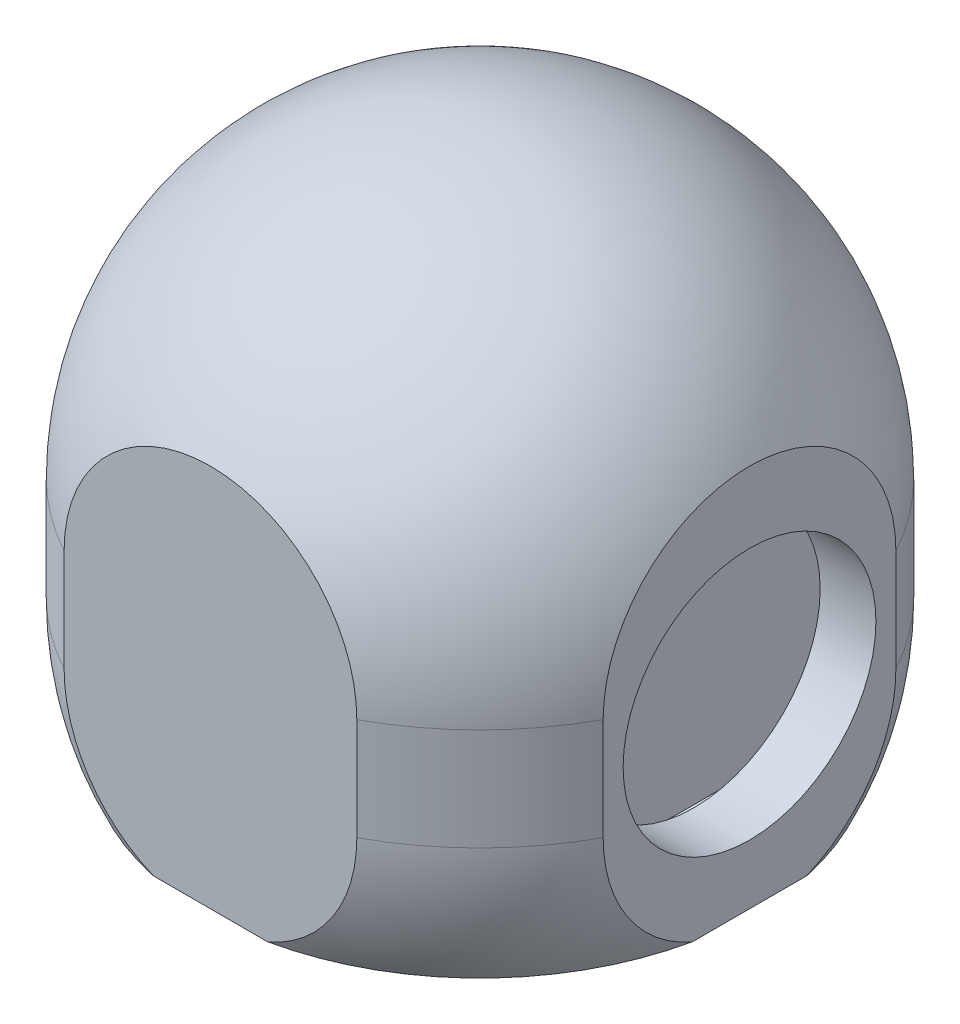
ISO-10303-21;
HEADER;
FILE_DESCRIPTION(('STEP AP214'),'2;1');
FILE_NAME('part.step','',(''),(''),'','','');
FILE_SCHEMA(('AUTOMOTIVE_DESIGN { 1 0 10303 214 1 1 1 1 }'));
ENDSEC;
DATA;
#1=APPLICATION_CONTEXT('core data for automotive mechanical design processes');
#2=APPLICATION_PROTOCOL_DEFINITION('international standard','automotive_design',2000,#1);
#3=PRODUCT_CONTEXT('',#1,'mechanical');
#4=PRODUCT('Part','Part','',(#3));
#5=PRODUCT_RELATED_PRODUCT_CATEGORY('part','',(#4));
#6=PRODUCT_DEFINITION_FORMATION('','',#4);
#7=PRODUCT_DEFINITION_CONTEXT('part definition',#1,'design');
#8=PRODUCT_DEFINITION('design','',#6,#7);
#9=PRODUCT_DEFINITION_SHAPE('','',#8);
#10=(LENGTH_UNIT() NAMED_UNIT(*) SI_UNIT(.MILLI.,.METRE.));
#11=(NAMED_UNIT(*) PLANE_ANGLE_UNIT() SI_UNIT($,.RADIAN.));
#12=(NAMED_UNIT(*) SI_UNIT($,.STERADIAN.) SOLID_ANGLE_UNIT());
#13=UNCERTAINTY_MEASURE_WITH_UNIT(LENGTH_MEASURE(1.E-05),#10,'distance_accuracy_value','');
#14=(GEOMETRIC_REPRESENTATION_CONTEXT(3) GLOBAL_UNCERTAINTY_ASSIGNED_CONTEXT((#13)) GLOBAL_UNIT_ASSIGNED_CONTEXT((#10,
#11,#12)) REPRESENTATION_CONTEXT('',''));
#15=CARTESIAN_POINT('',(0.,0.,0.));
#16=DIRECTION('',(0.,0.,1.));
#17=DIRECTION('',(1.,0.,0.));
#18=AXIS2_PLACEMENT_3D('',#15,#16,#17);
#19=CARTESIAN_POINT('',(0.,-41.5,0.));
#20=DIRECTION('',(0.,1.,0.));
#21=DIRECTION('',(0.,0.,1.));
#22=AXIS2_PLACEMENT_3D('',#19,#20,#21);
#23=PLANE('',#22);
#24=CARTESIAN_POINT('',(0.,-41.5,0.));
#25=DIRECTION('',(0.,1.,0.));
#26=DIRECTION('',(0.,0.,1.));
#27=AXIS2_PLACEMENT_3D('',#24,#25,#26);
#28=CIRCLE('',#27,69.408212770536);
#29=CARTESIAN_POINT('',(57.5000000000004,-41.5,-38.8747990348498));
#30=VERTEX_POINT('',#29);
#31=CARTESIAN_POINT('',(49.2499999999998,-41.5,-48.9074380846106));
#32=VERTEX_POINT('',#31);
#33=EDGE_CURVE('E416',#30,#32,#28,.T.);
#34=ORIENTED_EDGE('',*,*,#33,.T.);
#35=DIRECTION('',(0.,0.,1.));
#36=VECTOR('',#35,1.);
#37=CARTESIAN_POINT('',(49.2499999999998,-41.5,-56.2316636780383));
#38=LINE('',#37,#36);
#39=CARTESIAN_POINT('',(49.2499999999998,-41.5,48.9074380846106));
#40=VERTEX_POINT('',#39);
#41=EDGE_CURVE('E60',#32,#40,#38,.T.);
#42=ORIENTED_EDGE('',*,*,#41,.T.);
#43=CARTESIAN_POINT('',(0.,-41.5,0.));
#44=DIRECTION('',(0.,1.,0.));
#45=DIRECTION('',(0.,0.,1.));
#46=AXIS2_PLACEMENT_3D('',#43,#44,#45);
#47=CIRCLE('',#46,69.408212770536);
#48=CARTESIAN_POINT('',(57.4999999999996,-41.5,38.874799034851));
#49=VERTEX_POINT('',#48);
#50=EDGE_CURVE('E407',#40,#49,#47,.T.);
#51=ORIENTED_EDGE('',*,*,#50,.T.);
#52=DIRECTION('',(0.,0.,1.));
#53=VECTOR('',#52,1.);
#54=CARTESIAN_POINT('',(57.5,-41.5,6.0228053095044E-13));
#55=LINE('',#54,#53);
#56=EDGE_CURVE('E267',#30,#49,#55,.T.);
#57=ORIENTED_EDGE('',*,*,#56,.F.);
#58=EDGE_LOOP('',(#34,#42,#51,#57));
#59=FACE_BOUND('',#58,.T.);
#60=ADVANCED_FACE('F37',(#59),#23,.T.);
#61=CARTESIAN_POINT('',(0.,-41.5,0.));
#62=DIRECTION('',(0.,1.,0.));
#63=DIRECTION('',(0.,0.,1.));
#64=AXIS2_PLACEMENT_3D('',#61,#62,#63);
#65=CIRCLE('',#64,40.);
#66=CARTESIAN_POINT('',(0.,-41.5,40.));
#67=VERTEX_POINT('',#66);
#68=EDGE_CURVE('E461',#67,#67,#65,.T.);
#69=ORIENTED_EDGE('',*,*,#68,.F.);
#70=EDGE_LOOP('',(#69));
#71=FACE_BOUND('',#70,.T.);
#72=CARTESIAN_POINT('',(24.9987499687485,-41.5,64.75));
#73=VERTEX_POINT('',#72);
#74=CARTESIAN_POINT('',(44.2499999999998,-41.5,53.4737084930531));
#75=VERTEX_POINT('',#74);
#76=EDGE_CURVE('E413',#73,#75,#47,.T.);
#77=ORIENTED_EDGE('',*,*,#76,.T.);
#78=DIRECTION('',(0.,0.,-1.));
#79=VECTOR('',#78,1.);
#80=CARTESIAN_POINT('',(44.2499999999998,-41.5,-60.245331769358));
#81=LINE('',#80,#79);
#82=CARTESIAN_POINT('',(44.2499999999998,-41.5,-53.4737084930531));
#83=VERTEX_POINT('',#82);
#84=EDGE_CURVE('E484',#75,#83,#81,.T.);
#85=ORIENTED_EDGE('',*,*,#84,.T.);
#86=CARTESIAN_POINT('',(24.9987499687485,-41.5,-64.75));
#87=VERTEX_POINT('',#86);
#88=EDGE_CURVE('E387',#83,#87,#28,.T.);
#89=ORIENTED_EDGE('',*,*,#88,.T.);
#90=DIRECTION('',(1.,0.,0.));
#91=VECTOR('',#90,1.);
#92=CARTESIAN_POINT('',(0.,-41.5,-64.75));
#93=LINE('',#92,#91);
#94=CARTESIAN_POINT('',(-24.9987499687485,-41.5,-64.75));
#95=VERTEX_POINT('',#94);
#96=EDGE_CURVE('E399',#95,#87,#93,.T.);
#97=ORIENTED_EDGE('',*,*,#96,.F.);
#98=CARTESIAN_POINT('',(0.,-41.5,0.));
#99=DIRECTION('',(0.,1.,0.));
#100=DIRECTION('',(0.,0.,1.));
#101=AXIS2_PLACEMENT_3D('',#98,#99,#100);
#102=CIRCLE('',#101,69.408212770536);
#103=CARTESIAN_POINT('',(-57.4999999999999,-41.5,-38.8747990348506));
#104=VERTEX_POINT('',#103);
#105=EDGE_CURVE('E404',#95,#104,#102,.T.);
#106=ORIENTED_EDGE('',*,*,#105,.T.);
#107=DIRECTION('',(0.,0.,-1.));
#108=VECTOR('',#107,1.);
#109=CARTESIAN_POINT('',(-57.5,-41.5,-2.0076017698348E-13));
#110=LINE('',#109,#108);
#111=CARTESIAN_POINT('',(-57.5000000000001,-41.5,38.8747990348501));
#112=VERTEX_POINT('',#111);
#113=EDGE_CURVE('E376',#112,#104,#110,.T.);
#114=ORIENTED_EDGE('',*,*,#113,.F.);
#115=CARTESIAN_POINT('',(0.,-41.5,0.));
#116=DIRECTION('',(0.,1.,0.));
#117=DIRECTION('',(0.,0.,1.));
#118=AXIS2_PLACEMENT_3D('',#115,#116,#117);
#119=CIRCLE('',#118,69.408212770536);
#120=CARTESIAN_POINT('',(-24.9987499687485,-41.5,64.75));
#121=VERTEX_POINT('',#120);
#122=EDGE_CURVE('E409',#112,#121,#119,.T.);
#123=ORIENTED_EDGE('',*,*,#122,.T.);
#124=DIRECTION('',(-1.,0.,0.));
#125=VECTOR('',#124,1.);
#126=CARTESIAN_POINT('',(0.,-41.5,64.75));
#127=LINE('',#126,#125);
#128=EDGE_CURVE('E403',#73,#121,#127,.T.);
#129=ORIENTED_EDGE('',*,*,#128,.F.);
#130=EDGE_LOOP('',(#77,#85,#89,#97,#106,#114,#123,#129));
#131=FACE_BOUND('',#130,.T.);
#132=ADVANCED_FACE('F457',(#71,#131),#23,.T.);
#133=CARTESIAN_POINT('',(0.,13.75,0.));
#134=DIRECTION('',(0.,-1.,0.));
#135=DIRECTION('',(1.,0.,0.));
#136=AXIS2_PLACEMENT_3D('',#133,#134,#135);
#137=CYLINDRICAL_SURFACE('',#136,74.75);
#138=CARTESIAN_POINT('',(0.,-13.75,0.));
#139=DIRECTION('',(0.,-1.,0.));
#140=DIRECTION('',(1.,0.,0.));
#141=AXIS2_PLACEMENT_3D('',#138,#139,#140);
#142=CIRCLE('',#141,74.75);
#143=CARTESIAN_POINT('',(57.4999999999995,-13.75,47.7630872117796));
#144=VERTEX_POINT('',#143);
#145=CARTESIAN_POINT('',(49.2499999999999,-13.75,56.2316636780383));
#146=VERTEX_POINT('',#145);
#147=EDGE_CURVE('E249',#144,#146,#142,.T.);
#148=ORIENTED_EDGE('',*,*,#147,.T.);
#149=DIRECTION('',(0.,-1.,0.));
#150=VECTOR('',#149,1.);
#151=CARTESIAN_POINT('',(49.2499999999999,121.375708030891,56.2316636780383));
#152=LINE('',#151,#150);
#153=CARTESIAN_POINT('',(49.2499999999998,13.75,56.2316636780383));
#154=VERTEX_POINT('',#153);
#155=EDGE_CURVE('E234',#154,#146,#152,.T.);
#156=ORIENTED_EDGE('',*,*,#155,.F.);
#157=CARTESIAN_POINT('',(0.,13.75,0.));
#158=DIRECTION('',(0.,-1.,0.));
#159=DIRECTION('',(1.,0.,0.));
#160=AXIS2_PLACEMENT_3D('',#157,#158,#159);
#161=CIRCLE('',#160,74.75);
#162=CARTESIAN_POINT('',(57.4999999999995,13.75,47.7630872117796));
#163=VERTEX_POINT('',#162);
#164=EDGE_CURVE('E247',#163,#154,#161,.T.);
#165=ORIENTED_EDGE('',*,*,#164,.F.);
#166=DIRECTION('',(0.,-1.,0.));
#167=VECTOR('',#166,1.);
#168=CARTESIAN_POINT('',(57.4999999999995,13.75,47.7630872117796));
#169=LINE('',#168,#167);
#170=EDGE_CURVE('E266',#163,#144,#169,.T.);
#171=ORIENTED_EDGE('',*,*,#170,.T.);
#172=EDGE_LOOP('',(#148,#156,#165,#171));
#173=FACE_BOUND('',#172,.T.);
#174=ADVANCED_FACE('F246',(#173),#137,.F.);
#175=CARTESIAN_POINT('',(44.2499999999998,13.75,60.245331769358));
#176=VERTEX_POINT('',#175);
#177=CARTESIAN_POINT('',(37.3496987939662,13.75,64.75));
#178=VERTEX_POINT('',#177);
#179=EDGE_CURVE('E257',#176,#178,#161,.T.);
#180=ORIENTED_EDGE('',*,*,#179,.F.);
#181=DIRECTION('',(0.,-1.,0.));
#182=VECTOR('',#181,1.);
#183=CARTESIAN_POINT('',(44.2499999999998,121.375708030891,60.245331769358));
#184=LINE('',#183,#182);
#185=CARTESIAN_POINT('',(44.2499999999998,-13.75,60.245331769358));
#186=VERTEX_POINT('',#185);
#187=EDGE_CURVE('E250',#176,#186,#184,.T.);
#188=ORIENTED_EDGE('',*,*,#187,.T.);
#189=CARTESIAN_POINT('',(37.3496987939662,-13.75,64.75));
#190=VERTEX_POINT('',#189);
#191=EDGE_CURVE('E300',#186,#190,#142,.T.);
#192=ORIENTED_EDGE('',*,*,#191,.T.);
#193=DIRECTION('',(0.,-1.,0.));
#194=VECTOR('',#193,1.);
#195=CARTESIAN_POINT('',(37.3496987939662,-13.75,64.75));
#196=LINE('',#195,#194);
#197=EDGE_CURVE('E284',#190,#178,#196,.F.);
#198=ORIENTED_EDGE('',*,*,#197,.T.);
#199=EDGE_LOOP('',(#180,#188,#192,#198));
#200=FACE_BOUND('',#199,.T.);
#201=ADVANCED_FACE('F503',(#200),#137,.F.);
#202=CARTESIAN_POINT('',(0.,13.75,0.));
#203=DIRECTION('',(0.,-1.,0.));
#204=DIRECTION('',(1.,0.,0.));
#205=AXIS2_PLACEMENT_3D('',#202,#203,#204);
#206=CIRCLE('',#205,74.75);
#207=CARTESIAN_POINT('',(49.2499999999999,13.75,-56.2316636780384));
#208=VERTEX_POINT('',#207);
#209=CARTESIAN_POINT('',(57.5000000000005,13.75,-47.7630872117783));
#210=VERTEX_POINT('',#209);
#211=EDGE_CURVE('E256',#208,#210,#206,.T.);
#212=ORIENTED_EDGE('',*,*,#211,.F.);
#213=DIRECTION('',(0.,-1.,0.));
#214=VECTOR('',#213,1.);
#215=CARTESIAN_POINT('',(49.2499999999998,121.375708030891,-56.2316636780383));
#216=LINE('',#215,#214);
#217=CARTESIAN_POINT('',(49.2499999999998,-13.75,-56.2316636780383));
#218=VERTEX_POINT('',#217);
#219=EDGE_CURVE('E237',#208,#218,#216,.T.);
#220=ORIENTED_EDGE('',*,*,#219,.T.);
#221=CARTESIAN_POINT('',(0.,-13.75,0.));
#222=DIRECTION('',(0.,-1.,0.));
#223=DIRECTION('',(1.,0.,0.));
#224=AXIS2_PLACEMENT_3D('',#221,#222,#223);
#225=CIRCLE('',#224,74.75);
#226=CARTESIAN_POINT('',(57.5000000000005,-13.75,-47.7630872117783));
#227=VERTEX_POINT('',#226);
#228=EDGE_CURVE('E299',#218,#227,#225,.T.);
#229=ORIENTED_EDGE('',*,*,#228,.T.);
#230=DIRECTION('',(0.,-1.,0.));
#231=VECTOR('',#230,1.);
#232=CARTESIAN_POINT('',(57.5000000000005,-13.75,-47.7630872117783));
#233=LINE('',#232,#231);
#234=EDGE_CURVE('E274',#227,#210,#233,.F.);
#235=ORIENTED_EDGE('',*,*,#234,.T.);
#236=EDGE_LOOP('',(#212,#220,#229,#235));
#237=FACE_BOUND('',#236,.T.);
#238=ADVANCED_FACE('F501',(#237),#137,.F.);
#239=CARTESIAN_POINT('',(37.3496987939662,-13.75,-64.75));
#240=VERTEX_POINT('',#239);
#241=CARTESIAN_POINT('',(44.2499999999998,-13.75,-60.245331769358));
#242=VERTEX_POINT('',#241);
#243=EDGE_CURVE('E310',#240,#242,#225,.T.);
#244=ORIENTED_EDGE('',*,*,#243,.T.);
#245=DIRECTION('',(0.,-1.,0.));
#246=VECTOR('',#245,1.);
#247=CARTESIAN_POINT('',(44.2499999999998,121.375708030891,-60.245331769358));
#248=LINE('',#247,#246);
#249=CARTESIAN_POINT('',(44.2499999999998,13.75,-60.245331769358));
#250=VERTEX_POINT('',#249);
#251=EDGE_CURVE('E52',#250,#242,#248,.T.);
#252=ORIENTED_EDGE('',*,*,#251,.F.);
#253=CARTESIAN_POINT('',(37.3496987939662,13.75,-64.75));
#254=VERTEX_POINT('',#253);
#255=EDGE_CURVE('E259',#254,#250,#206,.T.);
#256=ORIENTED_EDGE('',*,*,#255,.F.);
#257=DIRECTION('',(0.,-1.,0.));
#258=VECTOR('',#257,1.);
#259=CARTESIAN_POINT('',(37.3496987939662,13.75,-64.75));
#260=LINE('',#259,#258);
#261=EDGE_CURVE('E273',#254,#240,#260,.T.);
#262=ORIENTED_EDGE('',*,*,#261,.T.);
#263=EDGE_LOOP('',(#244,#252,#256,#262));
#264=FACE_BOUND('',#263,.T.);
#265=ADVANCED_FACE('F390',(#264),#137,.F.);
#266=CARTESIAN_POINT('',(0.,13.75,0.));
#267=DIRECTION('',(0.,-1.,0.));
#268=DIRECTION('',(-1.,0.,0.));
#269=AXIS2_PLACEMENT_3D('',#266,#267,#268);
#270=SPHERICAL_SURFACE('',#269,74.75);
#271=ORIENTED_EDGE('',*,*,#164,.T.);
#272=CARTESIAN_POINT('',(49.2499999999998,13.75,0.));
#273=DIRECTION('',(-1.,0.,0.));
#274=DIRECTION('',(0.,0.,1.));
#275=AXIS2_PLACEMENT_3D('',#272,#273,#274);
#276=CIRCLE('',#275,56.2316636780383);
#277=EDGE_CURVE('E231',#208,#154,#276,.F.);
#278=ORIENTED_EDGE('',*,*,#277,.F.);
#279=ORIENTED_EDGE('',*,*,#211,.T.);
#280=CARTESIAN_POINT('',(57.5,13.75,6.0228053095044E-13));
#281=DIRECTION('',(1.,0.,0.));
#282=DIRECTION('',(0.,0.,-1.));
#283=AXIS2_PLACEMENT_3D('',#280,#281,#282);
#284=CIRCLE('',#283,47.763087211779);
#285=EDGE_CURVE('E254',#210,#163,#284,.T.);
#286=ORIENTED_EDGE('',*,*,#285,.T.);
#287=EDGE_LOOP('',(#271,#278,#279,#286));
#288=FACE_BOUND('',#287,.T.);
#289=ADVANCED_FACE('F252',(#288),#270,.F.);
#290=ORIENTED_EDGE('',*,*,#255,.T.);
#291=CARTESIAN_POINT('',(44.2499999999998,13.75,0.));
#292=DIRECTION('',(1.,0.,0.));
#293=DIRECTION('',(0.,0.,-1.));
#294=AXIS2_PLACEMENT_3D('',#291,#292,#293);
#295=CIRCLE('',#294,60.245331769358);
#296=EDGE_CURVE('E241',#176,#250,#295,.F.);
#297=ORIENTED_EDGE('',*,*,#296,.F.);
#298=ORIENTED_EDGE('',*,*,#179,.T.);
#299=CARTESIAN_POINT('',(0.,13.75,64.75));
#300=DIRECTION('',(0.,0.,1.));
#301=DIRECTION('',(1.,0.,0.));
#302=AXIS2_PLACEMENT_3D('',#299,#300,#301);
#303=CIRCLE('',#302,37.3496987939662);
#304=CARTESIAN_POINT('',(-37.3496987939662,13.75,64.75));
#305=VERTEX_POINT('',#304);
#306=EDGE_CURVE('E264',#178,#305,#303,.T.);
#307=ORIENTED_EDGE('',*,*,#306,.T.);
#308=CARTESIAN_POINT('',(0.,13.75,0.));
#309=DIRECTION('',(0.,-1.,0.));
#310=DIRECTION('',(1.,0.,0.));
#311=AXIS2_PLACEMENT_3D('',#308,#309,#310);
#312=CIRCLE('',#311,74.75);
#313=CARTESIAN_POINT('',(-57.5000000000002,13.75,47.7630872117788));
#314=VERTEX_POINT('',#313);
#315=EDGE_CURVE('E341',#305,#314,#312,.T.);
#316=ORIENTED_EDGE('',*,*,#315,.T.);
#317=CARTESIAN_POINT('',(-57.5,13.75,-2.0076017698348E-13));
#318=DIRECTION('',(-1.,0.,0.));
#319=DIRECTION('',(0.,0.,1.));
#320=AXIS2_PLACEMENT_3D('',#317,#318,#319);
#321=CIRCLE('',#320,47.763087211779);
#322=CARTESIAN_POINT('',(-57.4999999999998,13.75,-47.7630872117792));
#323=VERTEX_POINT('',#322);
#324=EDGE_CURVE('E429',#314,#323,#321,.T.);
#325=ORIENTED_EDGE('',*,*,#324,.T.);
#326=CARTESIAN_POINT('',(0.,13.75,0.));
#327=DIRECTION('',(0.,-1.,0.));
#328=DIRECTION('',(1.,0.,0.));
#329=AXIS2_PLACEMENT_3D('',#326,#327,#328);
#330=CIRCLE('',#329,74.75);
#331=CARTESIAN_POINT('',(-37.3496987939662,13.75,-64.75));
#332=VERTEX_POINT('',#331);
#333=EDGE_CURVE('E270',#323,#332,#330,.T.);
#334=ORIENTED_EDGE('',*,*,#333,.T.);
#335=CARTESIAN_POINT('',(0.,13.75,-64.75));
#336=DIRECTION('',(0.,0.,-1.));
#337=DIRECTION('',(-1.,0.,0.));
#338=AXIS2_PLACEMENT_3D('',#335,#336,#337);
#339=CIRCLE('',#338,37.3496987939662);
#340=EDGE_CURVE('E271',#332,#254,#339,.T.);
#341=ORIENTED_EDGE('',*,*,#340,.T.);
#342=EDGE_LOOP('',(#290,#297,#298,#307,#316,#325,#334,#341));
#343=FACE_BOUND('',#342,.T.);
#344=ADVANCED_FACE('F436',(#343),#270,.F.);
#345=CARTESIAN_POINT('',(0.,-13.75,0.));
#346=DIRECTION('',(0.,-1.,0.));
#347=DIRECTION('',(-1.,0.,0.));
#348=AXIS2_PLACEMENT_3D('',#345,#346,#347);
#349=SPHERICAL_SURFACE('',#348,74.75);
#350=ORIENTED_EDGE('',*,*,#50,.F.);
#351=CARTESIAN_POINT('',(49.2499999999998,-13.75,0.));
#352=DIRECTION('',(-1.,0.,0.));
#353=DIRECTION('',(0.,0.,1.));
#354=AXIS2_PLACEMENT_3D('',#351,#352,#353);
#355=CIRCLE('',#354,56.2316636780383);
#356=EDGE_CURVE('E475',#40,#146,#355,.T.);
#357=ORIENTED_EDGE('',*,*,#356,.T.);
#358=ORIENTED_EDGE('',*,*,#147,.F.);
#359=CARTESIAN_POINT('',(57.5,-13.75,6.0228053095044E-13));
#360=DIRECTION('',(1.,0.,0.));
#361=DIRECTION('',(0.,0.,-1.));
#362=AXIS2_PLACEMENT_3D('',#359,#360,#361);
#363=CIRCLE('',#362,47.763087211779);
#364=EDGE_CURVE('E294',#144,#49,#363,.T.);
#365=ORIENTED_EDGE('',*,*,#364,.T.);
#366=EDGE_LOOP('',(#350,#357,#358,#365));
#367=FACE_BOUND('',#366,.T.);
#368=ADVANCED_FACE('F491',(#367),#349,.F.);
#369=ORIENTED_EDGE('',*,*,#191,.F.);
#370=CARTESIAN_POINT('',(44.2499999999998,-13.75,0.));
#371=DIRECTION('',(1.,0.,0.));
#372=DIRECTION('',(0.,0.,-1.));
#373=AXIS2_PLACEMENT_3D('',#370,#371,#372);
#374=CIRCLE('',#373,60.245331769358);
#375=EDGE_CURVE('E477',#186,#75,#374,.T.);
#376=ORIENTED_EDGE('',*,*,#375,.T.);
#377=ORIENTED_EDGE('',*,*,#76,.F.);
#378=CARTESIAN_POINT('',(0.,-13.75,64.75));
#379=DIRECTION('',(0.,0.,1.));
#380=DIRECTION('',(1.,0.,0.));
#381=AXIS2_PLACEMENT_3D('',#378,#379,#380);
#382=CIRCLE('',#381,37.3496987939662);
#383=EDGE_CURVE('E277',#73,#190,#382,.T.);
#384=ORIENTED_EDGE('',*,*,#383,.T.);
#385=EDGE_LOOP('',(#369,#376,#377,#384));
#386=FACE_BOUND('',#385,.T.);
#387=ADVANCED_FACE('F531',(#386),#349,.F.);
#388=ORIENTED_EDGE('',*,*,#228,.F.);
#389=CARTESIAN_POINT('',(49.2499999999998,-13.75,0.));
#390=DIRECTION('',(-1.,0.,0.));
#391=DIRECTION('',(0.,0.,1.));
#392=AXIS2_PLACEMENT_3D('',#389,#390,#391);
#393=CIRCLE('',#392,56.2316636780383);
#394=EDGE_CURVE('E12',#218,#32,#393,.T.);
#395=ORIENTED_EDGE('',*,*,#394,.T.);
#396=ORIENTED_EDGE('',*,*,#33,.F.);
#397=CARTESIAN_POINT('',(57.5,-13.75,6.0228053095044E-13));
#398=DIRECTION('',(1.,0.,0.));
#399=DIRECTION('',(0.,0.,-1.));
#400=AXIS2_PLACEMENT_3D('',#397,#398,#399);
#401=CIRCLE('',#400,47.763087211779);
#402=EDGE_CURVE('E297',#30,#227,#401,.T.);
#403=ORIENTED_EDGE('',*,*,#402,.T.);
#404=EDGE_LOOP('',(#388,#395,#396,#403));
#405=FACE_BOUND('',#404,.T.);
#406=ADVANCED_FACE('F499',(#405),#349,.F.);
#407=ORIENTED_EDGE('',*,*,#88,.F.);
#408=CARTESIAN_POINT('',(44.2499999999998,-13.75,0.));
#409=DIRECTION('',(1.,0.,0.));
#410=DIRECTION('',(0.,0.,-1.));
#411=AXIS2_PLACEMENT_3D('',#408,#409,#410);
#412=CIRCLE('',#411,60.245331769358);
#413=EDGE_CURVE('E45',#83,#242,#412,.T.);
#414=ORIENTED_EDGE('',*,*,#413,.T.);
#415=ORIENTED_EDGE('',*,*,#243,.F.);
#416=CARTESIAN_POINT('',(0.,-13.75,-64.75));
#417=DIRECTION('',(0.,0.,-1.));
#418=DIRECTION('',(-1.,0.,0.));
#419=AXIS2_PLACEMENT_3D('',#416,#417,#418);
#420=CIRCLE('',#419,37.3496987939662);
#421=EDGE_CURVE('E306',#240,#87,#420,.T.);
#422=ORIENTED_EDGE('',*,*,#421,.T.);
#423=EDGE_LOOP('',(#407,#414,#415,#422));
#424=FACE_BOUND('',#423,.T.);
#425=ADVANCED_FACE('F386',(#424),#349,.F.);
#426=CARTESIAN_POINT('',(0.,-13.75,0.));
#427=DIRECTION('',(0.,-1.,0.));
#428=DIRECTION('',(-1.,0.,0.));
#429=AXIS2_PLACEMENT_3D('',#426,#427,#428);
#430=SPHERICAL_SURFACE('',#429,82.5);
#431=CARTESIAN_POINT('',(-72.5,-13.75,-2.52526452035299E-13));
#432=DIRECTION('',(-1.,0.,0.));
#433=DIRECTION('',(0.,0.,1.));
#434=AXIS2_PLACEMENT_3D('',#431,#432,#433);
#435=CIRCLE('',#434,39.3700393700591);
#436=CARTESIAN_POINT('',(-72.4999999999999,-13.75,-39.3700393700593));
#437=VERTEX_POINT('',#436);
#438=CARTESIAN_POINT('',(-72.4999999999999,-50.,-15.3602571593059));
#439=VERTEX_POINT('',#438);
#440=EDGE_CURVE('E319',#437,#439,#435,.T.);
#441=ORIENTED_EDGE('',*,*,#440,.F.);
#442=CARTESIAN_POINT('',(0.,-13.75,0.));
#443=DIRECTION('',(0.,-1.,0.));
#444=DIRECTION('',(1.,0.,0.));
#445=AXIS2_PLACEMENT_3D('',#442,#443,#444);
#446=CIRCLE('',#445,82.5);
#447=CARTESIAN_POINT('',(-39.3700393700591,-13.75,-72.5));
#448=VERTEX_POINT('',#447);
#449=EDGE_CURVE('E364',#437,#448,#446,.T.);
#450=ORIENTED_EDGE('',*,*,#449,.T.);
#451=CARTESIAN_POINT('',(0.,-13.75,-72.5));
#452=DIRECTION('',(0.,0.,-1.));
#453=DIRECTION('',(-1.,0.,0.));
#454=AXIS2_PLACEMENT_3D('',#451,#452,#453);
#455=CIRCLE('',#454,39.3700393700591);
#456=CARTESIAN_POINT('',(-15.3602571593057,-50.,-72.5));
#457=VERTEX_POINT('',#456);
#458=EDGE_CURVE('E335',#457,#448,#455,.T.);
#459=ORIENTED_EDGE('',*,*,#458,.F.);
#460=CARTESIAN_POINT('',(0.,-50.,0.));
#461=DIRECTION('',(0.,1.,0.));
#462=DIRECTION('',(0.,0.,1.));
#463=AXIS2_PLACEMENT_3D('',#460,#461,#462);
#464=CIRCLE('',#463,74.1092942889082);
#465=EDGE_CURVE('E613',#457,#439,#464,.T.);
#466=ORIENTED_EDGE('',*,*,#465,.T.);
#467=EDGE_LOOP('',(#441,#450,#459,#466));
#468=FACE_BOUND('',#467,.T.);
#469=ADVANCED_FACE('F39',(#468),#430,.T.);
#470=CARTESIAN_POINT('',(-72.5000000000001,-50.,15.3602571593054));
#471=VERTEX_POINT('',#470);
#472=CARTESIAN_POINT('',(-72.5000000000001,-13.75,39.3700393700588));
#473=VERTEX_POINT('',#472);
#474=EDGE_CURVE('E322',#471,#473,#435,.T.);
#475=ORIENTED_EDGE('',*,*,#474,.F.);
#476=CARTESIAN_POINT('',(-15.3602571593057,-50.,72.5));
#477=VERTEX_POINT('',#476);
#478=EDGE_CURVE('E359',#471,#477,#464,.T.);
#479=ORIENTED_EDGE('',*,*,#478,.T.);
#480=CARTESIAN_POINT('',(0.,-13.75,72.5));
#481=DIRECTION('',(0.,0.,1.));
#482=DIRECTION('',(1.,0.,0.));
#483=AXIS2_PLACEMENT_3D('',#480,#481,#482);
#484=CIRCLE('',#483,39.3700393700591);
#485=CARTESIAN_POINT('',(-39.3700393700591,-13.75,72.5));
#486=VERTEX_POINT('',#485);
#487=EDGE_CURVE('E351',#486,#477,#484,.T.);
#488=ORIENTED_EDGE('',*,*,#487,.F.);
#489=EDGE_CURVE('E360',#486,#473,#446,.T.);
#490=ORIENTED_EDGE('',*,*,#489,.T.);
#491=EDGE_LOOP('',(#475,#479,#488,#490));
#492=FACE_BOUND('',#491,.T.);
#493=ADVANCED_FACE('F610',(#492),#430,.T.);
#494=CARTESIAN_POINT('',(39.3700393700591,-13.75,-72.5));
#495=VERTEX_POINT('',#494);
#496=CARTESIAN_POINT('',(15.3602571593057,-50.,-72.5));
#497=VERTEX_POINT('',#496);
#498=EDGE_CURVE('E332',#495,#497,#455,.T.);
#499=ORIENTED_EDGE('',*,*,#498,.F.);
#500=CARTESIAN_POINT('',(72.5000000000004,-13.75,-39.3700393700583));
#501=VERTEX_POINT('',#500);
#502=EDGE_CURVE('E633',#495,#501,#446,.T.);
#503=ORIENTED_EDGE('',*,*,#502,.T.);
#504=CARTESIAN_POINT('',(72.5,-13.75,7.58791246167553E-13));
#505=DIRECTION('',(1.,0.,0.));
#506=DIRECTION('',(0.,0.,-1.));
#507=AXIS2_PLACEMENT_3D('',#504,#505,#506);
#508=CIRCLE('',#507,39.3700393700591);
#509=CARTESIAN_POINT('',(72.5000000000001,-50.,-15.3602571593049));
#510=VERTEX_POINT('',#509);
#511=EDGE_CURVE('E346',#510,#501,#508,.T.);
#512=ORIENTED_EDGE('',*,*,#511,.F.);
#513=EDGE_CURVE('E374',#510,#497,#464,.T.);
#514=ORIENTED_EDGE('',*,*,#513,.T.);
#515=EDGE_LOOP('',(#499,#503,#512,#514));
#516=FACE_BOUND('',#515,.T.);
#517=ADVANCED_FACE('F591',(#516),#430,.T.);
#518=CARTESIAN_POINT('',(72.4999999999996,-13.75,39.3700393700598));
#519=VERTEX_POINT('',#518);
#520=CARTESIAN_POINT('',(72.4999999999998,-50.,15.3602571593064));
#521=VERTEX_POINT('',#520);
#522=EDGE_CURVE('E343',#519,#521,#508,.T.);
#523=ORIENTED_EDGE('',*,*,#522,.F.);
#524=CARTESIAN_POINT('',(39.3700393700591,-13.75,72.5));
#525=VERTEX_POINT('',#524);
#526=EDGE_CURVE('E365',#519,#525,#446,.T.);
#527=ORIENTED_EDGE('',*,*,#526,.T.);
#528=CARTESIAN_POINT('',(15.3602571593057,-50.,72.5));
#529=VERTEX_POINT('',#528);
#530=EDGE_CURVE('E326',#529,#525,#484,.T.);
#531=ORIENTED_EDGE('',*,*,#530,.F.);
#532=EDGE_CURVE('E371',#529,#521,#464,.T.);
#533=ORIENTED_EDGE('',*,*,#532,.T.);
#534=EDGE_LOOP('',(#523,#527,#531,#533));
#535=FACE_BOUND('',#534,.T.);
#536=ADVANCED_FACE('F586',(#535),#430,.T.);
#537=CARTESIAN_POINT('',(0.,13.75,0.));
#538=DIRECTION('',(0.,-1.,0.));
#539=DIRECTION('',(-1.,0.,0.));
#540=AXIS2_PLACEMENT_3D('',#537,#538,#539);
#541=SPHERICAL_SURFACE('',#540,82.5);
#542=CARTESIAN_POINT('',(-72.5,13.75,-2.56998964199685E-13));
#543=DIRECTION('',(-1.,0.,0.));
#544=DIRECTION('',(0.,0.,1.));
#545=AXIS2_PLACEMENT_3D('',#542,#543,#544);
#546=CIRCLE('',#545,39.3700393700591);
#547=CARTESIAN_POINT('',(-72.5000000000001,13.75,39.3700393700588));
#548=VERTEX_POINT('',#547);
#549=CARTESIAN_POINT('',(-72.4999999999999,13.75,-39.3700393700593));
#550=VERTEX_POINT('',#549);
#551=EDGE_CURVE('E314',#548,#550,#546,.T.);
#552=ORIENTED_EDGE('',*,*,#551,.F.);
#553=CARTESIAN_POINT('',(0.,13.75,0.));
#554=DIRECTION('',(0.,-1.,0.));
#555=DIRECTION('',(1.,0.,0.));
#556=AXIS2_PLACEMENT_3D('',#553,#554,#555);
#557=CIRCLE('',#556,82.5);
#558=CARTESIAN_POINT('',(-39.3700393700591,13.75,72.5));
#559=VERTEX_POINT('',#558);
#560=EDGE_CURVE('E366',#559,#548,#557,.T.);
#561=ORIENTED_EDGE('',*,*,#560,.F.);
#562=CARTESIAN_POINT('',(0.,13.75,72.5));
#563=DIRECTION('',(0.,0.,1.));
#564=DIRECTION('',(1.,0.,0.));
#565=AXIS2_PLACEMENT_3D('',#562,#563,#564);
#566=CIRCLE('',#565,39.3700393700591);
#567=CARTESIAN_POINT('',(39.3700393700591,13.75,72.5));
#568=VERTEX_POINT('',#567);
#569=EDGE_CURVE('E357',#568,#559,#566,.T.);
#570=ORIENTED_EDGE('',*,*,#569,.F.);
#571=CARTESIAN_POINT('',(72.4999999999996,13.75,39.3700393700598));
#572=VERTEX_POINT('',#571);
#573=EDGE_CURVE('E363',#572,#568,#557,.T.);
#574=ORIENTED_EDGE('',*,*,#573,.F.);
#575=CARTESIAN_POINT('',(72.5,13.75,7.63263758331939E-13));
#576=DIRECTION('',(1.,0.,0.));
#577=DIRECTION('',(0.,0.,-1.));
#578=AXIS2_PLACEMENT_3D('',#575,#576,#577);
#579=CIRCLE('',#578,39.3700393700591);
#580=CARTESIAN_POINT('',(72.5000000000004,13.75,-39.3700393700583));
#581=VERTEX_POINT('',#580);
#582=EDGE_CURVE('E338',#581,#572,#579,.T.);
#583=ORIENTED_EDGE('',*,*,#582,.F.);
#584=CARTESIAN_POINT('',(39.3700393700591,13.75,-72.5));
#585=VERTEX_POINT('',#584);
#586=EDGE_CURVE('E642',#585,#581,#557,.T.);
#587=ORIENTED_EDGE('',*,*,#586,.F.);
#588=CARTESIAN_POINT('',(0.,13.75,-72.5));
#589=DIRECTION('',(0.,0.,-1.));
#590=DIRECTION('',(-1.,0.,0.));
#591=AXIS2_PLACEMENT_3D('',#588,#589,#590);
#592=CIRCLE('',#591,39.3700393700591);
#593=CARTESIAN_POINT('',(-39.3700393700591,13.75,-72.5));
#594=VERTEX_POINT('',#593);
#595=EDGE_CURVE('E327',#594,#585,#592,.T.);
#596=ORIENTED_EDGE('',*,*,#595,.F.);
#597=EDGE_CURVE('E370',#550,#594,#557,.T.);
#598=ORIENTED_EDGE('',*,*,#597,.F.);
#599=EDGE_LOOP('',(#552,#561,#570,#574,#583,#587,#596,#598));
#600=FACE_BOUND('',#599,.T.);
#601=ADVANCED_FACE('F583',(#600),#541,.T.);
#602=CARTESIAN_POINT('',(0.,13.75,0.));
#603=DIRECTION('',(0.,-1.,0.));
#604=DIRECTION('',(1.,0.,0.));
#605=AXIS2_PLACEMENT_3D('',#602,#603,#604);
#606=CYLINDRICAL_SURFACE('',#605,82.5);
#607=DIRECTION('',(0.,-1.,0.));
#608=VECTOR('',#607,1.);
#609=CARTESIAN_POINT('',(-72.4999999999999,13.75,-39.3700393700593));
#610=LINE('',#609,#608);
#611=EDGE_CURVE('E316',#550,#437,#610,.T.);
#612=ORIENTED_EDGE('',*,*,#611,.F.);
#613=ORIENTED_EDGE('',*,*,#597,.T.);
#614=DIRECTION('',(0.,-1.,0.));
#615=VECTOR('',#614,1.);
#616=CARTESIAN_POINT('',(-39.3700393700591,13.75,-72.5));
#617=LINE('',#616,#615);
#618=EDGE_CURVE('E317',#448,#594,#617,.F.);
#619=ORIENTED_EDGE('',*,*,#618,.F.);
#620=ORIENTED_EDGE('',*,*,#449,.F.);
#621=EDGE_LOOP('',(#612,#613,#619,#620));
#622=FACE_BOUND('',#621,.T.);
#623=ADVANCED_FACE('F580',(#622),#606,.T.);
#624=DIRECTION('',(0.,-1.,0.));
#625=VECTOR('',#624,1.);
#626=CARTESIAN_POINT('',(-72.5000000000001,13.75,39.3700393700588));
#627=LINE('',#626,#625);
#628=EDGE_CURVE('E324',#473,#548,#627,.F.);
#629=ORIENTED_EDGE('',*,*,#628,.F.);
#630=ORIENTED_EDGE('',*,*,#489,.F.);
#631=DIRECTION('',(0.,-1.,0.));
#632=VECTOR('',#631,1.);
#633=CARTESIAN_POINT('',(-39.3700393700591,13.75,72.5));
#634=LINE('',#633,#632);
#635=EDGE_CURVE('E355',#559,#486,#634,.T.);
#636=ORIENTED_EDGE('',*,*,#635,.F.);
#637=ORIENTED_EDGE('',*,*,#560,.T.);
#638=EDGE_LOOP('',(#629,#630,#636,#637));
#639=FACE_BOUND('',#638,.T.);
#640=ADVANCED_FACE('F582',(#639),#606,.T.);
#641=DIRECTION('',(0.,-1.,0.));
#642=VECTOR('',#641,1.);
#643=CARTESIAN_POINT('',(39.3700393700591,13.75,-72.5));
#644=LINE('',#643,#642);
#645=EDGE_CURVE('E329',#585,#495,#644,.T.);
#646=ORIENTED_EDGE('',*,*,#645,.F.);
#647=ORIENTED_EDGE('',*,*,#586,.T.);
#648=DIRECTION('',(0.,-1.,0.));
#649=VECTOR('',#648,1.);
#650=CARTESIAN_POINT('',(72.5000000000004,13.75,-39.3700393700583));
#651=LINE('',#650,#649);
#652=EDGE_CURVE('E330',#501,#581,#651,.F.);
#653=ORIENTED_EDGE('',*,*,#652,.F.);
#654=ORIENTED_EDGE('',*,*,#502,.F.);
#655=EDGE_LOOP('',(#646,#647,#653,#654));
#656=FACE_BOUND('',#655,.T.);
#657=ADVANCED_FACE('F649',(#656),#606,.T.);
#658=DIRECTION('',(0.,-1.,0.));
#659=VECTOR('',#658,1.);
#660=CARTESIAN_POINT('',(72.4999999999996,13.75,39.3700393700598));
#661=LINE('',#660,#659);
#662=EDGE_CURVE('E340',#572,#519,#661,.T.);
#663=ORIENTED_EDGE('',*,*,#662,.F.);
#664=ORIENTED_EDGE('',*,*,#573,.T.);
#665=DIRECTION('',(0.,-1.,0.));
#666=VECTOR('',#665,1.);
#667=CARTESIAN_POINT('',(39.3700393700591,13.75,72.5));
#668=LINE('',#667,#666);
#669=EDGE_CURVE('E352',#525,#568,#668,.F.);
#670=ORIENTED_EDGE('',*,*,#669,.F.);
#671=ORIENTED_EDGE('',*,*,#526,.F.);
#672=EDGE_LOOP('',(#663,#664,#670,#671));
#673=FACE_BOUND('',#672,.T.);
#674=ADVANCED_FACE('F578',(#673),#606,.T.);
#675=CARTESIAN_POINT('',(0.,-50.,0.));
#676=DIRECTION('',(0.,1.,0.));
#677=DIRECTION('',(0.,0.,1.));
#678=AXIS2_PLACEMENT_3D('',#675,#676,#677);
#679=PLANE('',#678);
#680=DIRECTION('',(0.,0.,1.));
#681=VECTOR('',#680,1.);
#682=CARTESIAN_POINT('',(-72.5,-50.,-2.5112379076298E-13));
#683=LINE('',#682,#681);
#684=EDGE_CURVE('E321',#439,#471,#683,.T.);
#685=ORIENTED_EDGE('',*,*,#684,.F.);
#686=ORIENTED_EDGE('',*,*,#465,.F.);
#687=DIRECTION('',(-1.,0.,0.));
#688=VECTOR('',#687,1.);
#689=CARTESIAN_POINT('',(0.,-50.,-72.5));
#690=LINE('',#689,#688);
#691=EDGE_CURVE('E334',#497,#457,#690,.T.);
#692=ORIENTED_EDGE('',*,*,#691,.F.);
#693=ORIENTED_EDGE('',*,*,#513,.F.);
#694=DIRECTION('',(0.,0.,-1.));
#695=VECTOR('',#694,1.);
#696=CARTESIAN_POINT('',(72.5,-50.,7.57388584895234E-13));
#697=LINE('',#696,#695);
#698=EDGE_CURVE('E345',#521,#510,#697,.T.);
#699=ORIENTED_EDGE('',*,*,#698,.F.);
#700=ORIENTED_EDGE('',*,*,#532,.F.);
#701=DIRECTION('',(1.,0.,0.));
#702=VECTOR('',#701,1.);
#703=CARTESIAN_POINT('',(0.,-50.,72.5));
#704=LINE('',#703,#702);
#705=EDGE_CURVE('E369',#477,#529,#704,.T.);
#706=ORIENTED_EDGE('',*,*,#705,.F.);
#707=ORIENTED_EDGE('',*,*,#478,.F.);
#708=EDGE_LOOP('',(#685,#686,#692,#693,#699,#700,#706,#707));
#709=FACE_BOUND('',#708,.T.);
#710=CARTESIAN_POINT('',(0.,-50.,0.));
#711=DIRECTION('',(0.,1.,0.));
#712=DIRECTION('',(0.,0.,1.));
#713=AXIS2_PLACEMENT_3D('',#710,#711,#712);
#714=CIRCLE('',#713,40.);
#715=CARTESIAN_POINT('',(0.,-50.,40.));
#716=VERTEX_POINT('',#715);
#717=EDGE_CURVE('E463',#716,#716,#714,.T.);
#718=ORIENTED_EDGE('',*,*,#717,.T.);
#719=EDGE_LOOP('',(#718));
#720=FACE_BOUND('',#719,.T.);
#721=ADVANCED_FACE('F574',(#709,#720),#679,.F.);
#722=CARTESIAN_POINT('',(0.,0.,72.5));
#723=DIRECTION('',(0.,0.,1.));
#724=DIRECTION('',(1.,0.,0.));
#725=AXIS2_PLACEMENT_3D('',#722,#723,#724);
#726=PLANE('',#725);
#727=ORIENTED_EDGE('',*,*,#705,.T.);
#728=ORIENTED_EDGE('',*,*,#530,.T.);
#729=ORIENTED_EDGE('',*,*,#669,.T.);
#730=ORIENTED_EDGE('',*,*,#569,.T.);
#731=ORIENTED_EDGE('',*,*,#635,.T.);
#732=ORIENTED_EDGE('',*,*,#487,.T.);
#733=EDGE_LOOP('',(#727,#728,#729,#730,#731,#732));
#734=FACE_BOUND('',#733,.T.);
#735=ADVANCED_FACE('F570',(#734),#726,.T.);
#736=CARTESIAN_POINT('',(72.5,0.,7.59397191198381E-13));
#737=DIRECTION('',(1.,0.,0.));
#738=DIRECTION('',(0.,0.,-1.));
#739=AXIS2_PLACEMENT_3D('',#736,#737,#738);
#740=PLANE('',#739);
#741=CARTESIAN_POINT('',(72.5000000000004,0.,0.));
#742=DIRECTION('',(1.,0.,0.));
#743=DIRECTION('',(0.,0.,-1.));
#744=AXIS2_PLACEMENT_3D('',#741,#742,#743);
#745=CIRCLE('',#744,34.);
#746=CARTESIAN_POINT('',(72.5000000000004,0.,-34.));
#747=VERTEX_POINT('',#746);
#748=EDGE_CURVE('E472',#747,#747,#745,.T.);
#749=ORIENTED_EDGE('',*,*,#748,.F.);
#750=EDGE_LOOP('',(#749));
#751=FACE_BOUND('',#750,.T.);
#752=ORIENTED_EDGE('',*,*,#522,.T.);
#753=ORIENTED_EDGE('',*,*,#698,.T.);
#754=ORIENTED_EDGE('',*,*,#511,.T.);
#755=ORIENTED_EDGE('',*,*,#652,.T.);
#756=ORIENTED_EDGE('',*,*,#582,.T.);
#757=ORIENTED_EDGE('',*,*,#662,.T.);
#758=EDGE_LOOP('',(#752,#753,#754,#755,#756,#757));
#759=FACE_BOUND('',#758,.T.);
#760=ADVANCED_FACE('F566',(#751,#759),#740,.T.);
#761=CARTESIAN_POINT('',(0.,0.,-72.5));
#762=DIRECTION('',(0.,0.,-1.));
#763=DIRECTION('',(-1.,0.,0.));
#764=AXIS2_PLACEMENT_3D('',#761,#762,#763);
#765=PLANE('',#764);
#766=ORIENTED_EDGE('',*,*,#498,.T.);
#767=ORIENTED_EDGE('',*,*,#691,.T.);
#768=ORIENTED_EDGE('',*,*,#458,.T.);
#769=ORIENTED_EDGE('',*,*,#618,.T.);
#770=ORIENTED_EDGE('',*,*,#595,.T.);
#771=ORIENTED_EDGE('',*,*,#645,.T.);
#772=EDGE_LOOP('',(#766,#767,#768,#769,#770,#771));
#773=FACE_BOUND('',#772,.T.);
#774=ADVANCED_FACE('F562',(#773),#765,.T.);
#775=CARTESIAN_POINT('',(-72.5,0.,-2.53132397066127E-13));
#776=DIRECTION('',(-1.,0.,0.));
#777=DIRECTION('',(0.,0.,1.));
#778=AXIS2_PLACEMENT_3D('',#775,#776,#777);
#779=PLANE('',#778);
#780=CARTESIAN_POINT('',(-72.5000000000001,0.,0.));
#781=DIRECTION('',(1.,0.,0.));
#782=DIRECTION('',(0.,0.,-1.));
#783=AXIS2_PLACEMENT_3D('',#780,#781,#782);
#784=CIRCLE('',#783,34.);
#785=CARTESIAN_POINT('',(-72.5000000000001,0.,-34.));
#786=VERTEX_POINT('',#785);
#787=EDGE_CURVE('E382',#786,#786,#784,.T.);
#788=ORIENTED_EDGE('',*,*,#787,.T.);
#789=EDGE_LOOP('',(#788));
#790=FACE_BOUND('',#789,.T.);
#791=ORIENTED_EDGE('',*,*,#440,.T.);
#792=ORIENTED_EDGE('',*,*,#684,.T.);
#793=ORIENTED_EDGE('',*,*,#474,.T.);
#794=ORIENTED_EDGE('',*,*,#628,.T.);
#795=ORIENTED_EDGE('',*,*,#551,.T.);
#796=ORIENTED_EDGE('',*,*,#611,.T.);
#797=EDGE_LOOP('',(#791,#792,#793,#794,#795,#796));
#798=FACE_BOUND('',#797,.T.);
#799=ADVANCED_FACE('F559',(#790,#798),#779,.T.);
#800=CARTESIAN_POINT('',(0.,-41.5,0.));
#801=DIRECTION('',(0.,-1.,0.));
#802=DIRECTION('',(0.,0.,-1.));
#803=AXIS2_PLACEMENT_3D('',#800,#801,#802);
#804=CYLINDRICAL_SURFACE('',#803,40.);
#805=ORIENTED_EDGE('',*,*,#68,.T.);
#806=EDGE_LOOP('',(#805));
#807=FACE_BOUND('',#806,.T.);
#808=ORIENTED_EDGE('',*,*,#717,.F.);
#809=EDGE_LOOP('',(#808));
#810=FACE_BOUND('',#809,.T.);
#811=ADVANCED_FACE('F520',(#807,#810),#804,.F.);
#812=DIRECTION('',(0.,-1.,0.));
#813=VECTOR('',#812,1.);
#814=CARTESIAN_POINT('',(-57.5000000000002,-13.75,47.7630872117788));
#815=LINE('',#814,#813);
#816=CARTESIAN_POINT('',(-57.5000000000002,-13.75,47.7630872117788));
#817=VERTEX_POINT('',#816);
#818=EDGE_CURVE('E275',#817,#314,#815,.F.);
#819=ORIENTED_EDGE('',*,*,#818,.T.);
#820=ORIENTED_EDGE('',*,*,#315,.F.);
#821=DIRECTION('',(0.,-1.,0.));
#822=VECTOR('',#821,1.);
#823=CARTESIAN_POINT('',(-37.3496987939662,13.75,64.75));
#824=LINE('',#823,#822);
#825=CARTESIAN_POINT('',(-37.3496987939662,-13.75,64.75));
#826=VERTEX_POINT('',#825);
#827=EDGE_CURVE('E282',#305,#826,#824,.T.);
#828=ORIENTED_EDGE('',*,*,#827,.T.);
#829=CARTESIAN_POINT('',(0.,-13.75,0.));
#830=DIRECTION('',(0.,-1.,0.));
#831=DIRECTION('',(1.,0.,0.));
#832=AXIS2_PLACEMENT_3D('',#829,#830,#831);
#833=CIRCLE('',#832,74.75);
#834=EDGE_CURVE('E261',#826,#817,#833,.T.);
#835=ORIENTED_EDGE('',*,*,#834,.T.);
#836=EDGE_LOOP('',(#819,#820,#828,#835));
#837=FACE_BOUND('',#836,.T.);
#838=ADVANCED_FACE('F442',(#837),#137,.F.);
#839=DIRECTION('',(0.,-1.,0.));
#840=VECTOR('',#839,1.);
#841=CARTESIAN_POINT('',(-57.4999999999998,13.75,-47.7630872117792));
#842=LINE('',#841,#840);
#843=CARTESIAN_POINT('',(-57.4999999999998,-13.75,-47.7630872117792));
#844=VERTEX_POINT('',#843);
#845=EDGE_CURVE('E423',#323,#844,#842,.T.);
#846=ORIENTED_EDGE('',*,*,#845,.T.);
#847=CARTESIAN_POINT('',(0.,-13.75,0.));
#848=DIRECTION('',(0.,-1.,0.));
#849=DIRECTION('',(1.,0.,0.));
#850=AXIS2_PLACEMENT_3D('',#847,#848,#849);
#851=CIRCLE('',#850,74.75);
#852=CARTESIAN_POINT('',(-37.3496987939662,-13.75,-64.75));
#853=VERTEX_POINT('',#852);
#854=EDGE_CURVE('E281',#844,#853,#851,.T.);
#855=ORIENTED_EDGE('',*,*,#854,.T.);
#856=DIRECTION('',(0.,-1.,0.));
#857=VECTOR('',#856,1.);
#858=CARTESIAN_POINT('',(-37.3496987939662,-13.75,-64.75));
#859=LINE('',#858,#857);
#860=EDGE_CURVE('E427',#853,#332,#859,.F.);
#861=ORIENTED_EDGE('',*,*,#860,.T.);
#862=ORIENTED_EDGE('',*,*,#333,.F.);
#863=EDGE_LOOP('',(#846,#855,#861,#862));
#864=FACE_BOUND('',#863,.T.);
#865=ADVANCED_FACE('F453',(#864),#137,.F.);
#866=CARTESIAN_POINT('',(0.,0.,-64.75));
#867=DIRECTION('',(0.,0.,-1.));
#868=DIRECTION('',(-1.,0.,0.));
#869=AXIS2_PLACEMENT_3D('',#866,#867,#868);
#870=PLANE('',#869);
#871=CARTESIAN_POINT('',(0.,-13.75,-64.75));
#872=DIRECTION('',(0.,0.,-1.));
#873=DIRECTION('',(-1.,0.,0.));
#874=AXIS2_PLACEMENT_3D('',#871,#872,#873);
#875=CIRCLE('',#874,37.3496987939662);
#876=EDGE_CURVE('E309',#95,#853,#875,.T.);
#877=ORIENTED_EDGE('',*,*,#876,.F.);
#878=ORIENTED_EDGE('',*,*,#96,.T.);
#879=ORIENTED_EDGE('',*,*,#421,.F.);
#880=ORIENTED_EDGE('',*,*,#261,.F.);
#881=ORIENTED_EDGE('',*,*,#340,.F.);
#882=ORIENTED_EDGE('',*,*,#860,.F.);
#883=EDGE_LOOP('',(#877,#878,#879,#880,#881,#882));
#884=FACE_BOUND('',#883,.T.);
#885=ADVANCED_FACE('F398',(#884),#870,.F.);
#886=CARTESIAN_POINT('',(57.5,0.,6.0228053095044E-13));
#887=DIRECTION('',(1.,0.,0.));
#888=DIRECTION('',(0.,0.,-1.));
#889=AXIS2_PLACEMENT_3D('',#886,#887,#888);
#890=PLANE('',#889);
#891=CARTESIAN_POINT('',(57.5,0.,0.));
#892=DIRECTION('',(1.,0.,0.));
#893=DIRECTION('',(0.,0.,-1.));
#894=AXIS2_PLACEMENT_3D('',#891,#892,#893);
#895=CIRCLE('',#894,34.);
#896=CARTESIAN_POINT('',(57.5000000000003,0.,-34.));
#897=VERTEX_POINT('',#896);
#898=EDGE_CURVE('E381',#897,#897,#895,.T.);
#899=ORIENTED_EDGE('',*,*,#898,.T.);
#900=EDGE_LOOP('',(#899));
#901=FACE_BOUND('',#900,.T.);
#902=ORIENTED_EDGE('',*,*,#402,.F.);
#903=ORIENTED_EDGE('',*,*,#56,.T.);
#904=ORIENTED_EDGE('',*,*,#364,.F.);
#905=ORIENTED_EDGE('',*,*,#170,.F.);
#906=ORIENTED_EDGE('',*,*,#285,.F.);
#907=ORIENTED_EDGE('',*,*,#234,.F.);
#908=EDGE_LOOP('',(#902,#903,#904,#905,#906,#907));
#909=FACE_BOUND('',#908,.T.);
#910=ADVANCED_FACE('F495',(#901,#909),#890,.F.);
#911=CARTESIAN_POINT('',(0.,0.,64.75));
#912=DIRECTION('',(0.,0.,1.));
#913=DIRECTION('',(1.,0.,0.));
#914=AXIS2_PLACEMENT_3D('',#911,#912,#913);
#915=PLANE('',#914);
#916=ORIENTED_EDGE('',*,*,#383,.F.);
#917=ORIENTED_EDGE('',*,*,#128,.T.);
#918=CARTESIAN_POINT('',(0.,-13.75,64.75));
#919=DIRECTION('',(0.,0.,1.));
#920=DIRECTION('',(1.,0.,0.));
#921=AXIS2_PLACEMENT_3D('',#918,#919,#920);
#922=CIRCLE('',#921,37.3496987939662);
#923=EDGE_CURVE('E287',#826,#121,#922,.T.);
#924=ORIENTED_EDGE('',*,*,#923,.F.);
#925=ORIENTED_EDGE('',*,*,#827,.F.);
#926=ORIENTED_EDGE('',*,*,#306,.F.);
#927=ORIENTED_EDGE('',*,*,#197,.F.);
#928=EDGE_LOOP('',(#916,#917,#924,#925,#926,#927));
#929=FACE_BOUND('',#928,.T.);
#930=ADVANCED_FACE('F546',(#929),#915,.F.);
#931=CARTESIAN_POINT('',(-57.5,0.,-2.0076017698348E-13));
#932=DIRECTION('',(-1.,0.,0.));
#933=DIRECTION('',(0.,0.,1.));
#934=AXIS2_PLACEMENT_3D('',#931,#932,#933);
#935=PLANE('',#934);
#936=CARTESIAN_POINT('',(-57.5,0.,0.));
#937=DIRECTION('',(-1.,0.,0.));
#938=DIRECTION('',(0.,0.,1.));
#939=AXIS2_PLACEMENT_3D('',#936,#937,#938);
#940=CIRCLE('',#939,34.);
#941=CARTESIAN_POINT('',(-57.5000000000001,0.,34.));
#942=VERTEX_POINT('',#941);
#943=EDGE_CURVE('E379',#942,#942,#940,.T.);
#944=ORIENTED_EDGE('',*,*,#943,.T.);
#945=EDGE_LOOP('',(#944));
#946=FACE_BOUND('',#945,.T.);
#947=CARTESIAN_POINT('',(-57.5,-13.75,-2.0076017698348E-13));
#948=DIRECTION('',(-1.,0.,0.));
#949=DIRECTION('',(0.,0.,1.));
#950=AXIS2_PLACEMENT_3D('',#947,#948,#949);
#951=CIRCLE('',#950,47.763087211779);
#952=EDGE_CURVE('E278',#112,#817,#951,.T.);
#953=ORIENTED_EDGE('',*,*,#952,.F.);
#954=ORIENTED_EDGE('',*,*,#113,.T.);
#955=CARTESIAN_POINT('',(-57.5,-13.75,-2.0076017698348E-13));
#956=DIRECTION('',(-1.,0.,0.));
#957=DIRECTION('',(0.,0.,1.));
#958=AXIS2_PLACEMENT_3D('',#955,#956,#957);
#959=CIRCLE('',#958,47.763087211779);
#960=EDGE_CURVE('E286',#844,#104,#959,.T.);
#961=ORIENTED_EDGE('',*,*,#960,.F.);
#962=ORIENTED_EDGE('',*,*,#845,.F.);
#963=ORIENTED_EDGE('',*,*,#324,.F.);
#964=ORIENTED_EDGE('',*,*,#818,.F.);
#965=EDGE_LOOP('',(#953,#954,#961,#962,#963,#964));
#966=FACE_BOUND('',#965,.T.);
#967=ADVANCED_FACE('F448',(#946,#966),#935,.F.);
#968=ORIENTED_EDGE('',*,*,#122,.F.);
#969=ORIENTED_EDGE('',*,*,#952,.T.);
#970=ORIENTED_EDGE('',*,*,#834,.F.);
#971=ORIENTED_EDGE('',*,*,#923,.T.);
#972=EDGE_LOOP('',(#968,#969,#970,#971));
#973=FACE_BOUND('',#972,.T.);
#974=ADVANCED_FACE('F460',(#973),#349,.F.);
#975=ORIENTED_EDGE('',*,*,#105,.F.);
#976=ORIENTED_EDGE('',*,*,#876,.T.);
#977=ORIENTED_EDGE('',*,*,#854,.F.);
#978=ORIENTED_EDGE('',*,*,#960,.T.);
#979=EDGE_LOOP('',(#975,#976,#977,#978));
#980=FACE_BOUND('',#979,.T.);
#981=ADVANCED_FACE('F456',(#980),#349,.F.);
#982=CARTESIAN_POINT('',(-72.5000000000001,0.,0.));
#983=DIRECTION('',(1.,0.,0.));
#984=DIRECTION('',(0.,0.,-1.));
#985=AXIS2_PLACEMENT_3D('',#982,#983,#984);
#986=CYLINDRICAL_SURFACE('',#985,34.);
#987=ORIENTED_EDGE('',*,*,#787,.F.);
#988=EDGE_LOOP('',(#987));
#989=FACE_BOUND('',#988,.T.);
#990=ORIENTED_EDGE('',*,*,#943,.F.);
#991=EDGE_LOOP('',(#990));
#992=FACE_BOUND('',#991,.T.);
#993=ADVANCED_FACE('F523',(#989,#992),#986,.F.);
#994=ORIENTED_EDGE('',*,*,#748,.T.);
#995=EDGE_LOOP('',(#994));
#996=FACE_BOUND('',#995,.T.);
#997=ORIENTED_EDGE('',*,*,#898,.F.);
#998=EDGE_LOOP('',(#997));
#999=FACE_BOUND('',#998,.T.);
#1000=ADVANCED_FACE('F760',(#996,#999),#986,.F.);
#1001=CARTESIAN_POINT('',(44.2499999999998,121.375708030891,-60.245331769358));
#1002=DIRECTION('',(1.,0.,0.));
#1003=DIRECTION('',(0.,0.,-1.));
#1004=AXIS2_PLACEMENT_3D('',#1001,#1002,#1003);
#1005=PLANE('',#1004);
#1006=ORIENTED_EDGE('',*,*,#375,.F.);
#1007=ORIENTED_EDGE('',*,*,#187,.F.);
#1008=ORIENTED_EDGE('',*,*,#296,.T.);
#1009=ORIENTED_EDGE('',*,*,#251,.T.);
#1010=ORIENTED_EDGE('',*,*,#413,.F.);
#1011=ORIENTED_EDGE('',*,*,#84,.F.);
#1012=EDGE_LOOP('',(#1006,#1007,#1008,#1009,#1010,#1011));
#1013=FACE_BOUND('',#1012,.T.);
#1014=ADVANCED_FACE('F544',(#1013),#1005,.F.);
#1015=CARTESIAN_POINT('',(49.2499999999998,121.375708030891,-56.2316636780383));
#1016=DIRECTION('',(-1.,0.,0.));
#1017=DIRECTION('',(0.,0.,1.));
#1018=AXIS2_PLACEMENT_3D('',#1015,#1016,#1017);
#1019=PLANE('',#1018);
#1020=ORIENTED_EDGE('',*,*,#356,.F.);
#1021=ORIENTED_EDGE('',*,*,#41,.F.);
#1022=ORIENTED_EDGE('',*,*,#394,.F.);
#1023=ORIENTED_EDGE('',*,*,#219,.F.);
#1024=ORIENTED_EDGE('',*,*,#277,.T.);
#1025=ORIENTED_EDGE('',*,*,#155,.T.);
#1026=EDGE_LOOP('',(#1020,#1021,#1022,#1023,#1024,#1025));
#1027=FACE_BOUND('',#1026,.T.);
#1028=ADVANCED_FACE('F233',(#1027),#1019,.F.);
#1029=CLOSED_SHELL('',(#60,#132,#174,#201,#238,#265,#289,#344,#368,#387,#406,#425,#469,#493,
#517,#536,#601,#623,#640,#657,#674,#721,#735,#760,#774,#799,#811,#838,#865,#885,#910,#930,#967,
#974,#981,#993,#1000,#1014,#1028));
#1030=MANIFOLD_SOLID_BREP('B2',#1029);
#1031=ADVANCED_BREP_SHAPE_REPRESENTATION('',(#18,#1030),#14);
#1032=SHAPE_DEFINITION_REPRESENTATION(#9,#1031);
ENDSEC;
END-ISO-10303-21;
